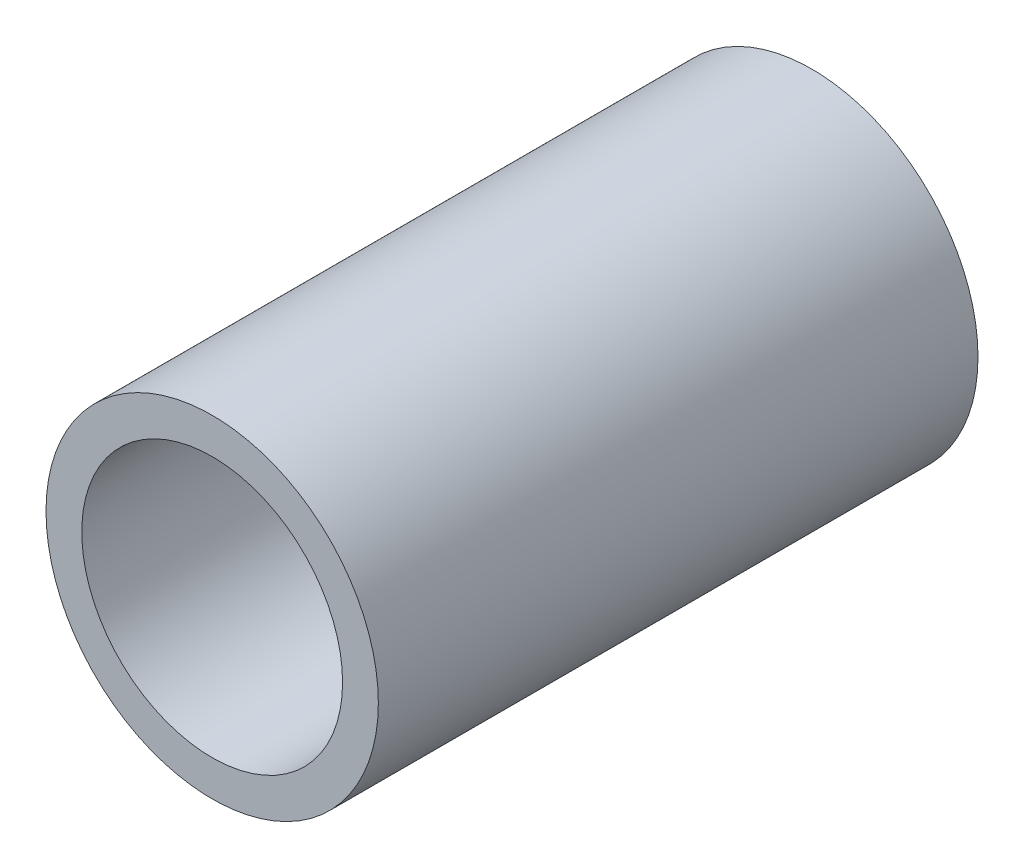
ISO-10303-21;
HEADER;
FILE_DESCRIPTION(('STEP AP214'),'2;1');
FILE_NAME('part.step','',(''),(''),'','','');
FILE_SCHEMA(('AUTOMOTIVE_DESIGN { 1 0 10303 214 1 1 1 1 }'));
ENDSEC;
DATA;
#1=APPLICATION_CONTEXT('core data for automotive mechanical design processes');
#2=APPLICATION_PROTOCOL_DEFINITION('international standard','automotive_design',2000,#1);
#3=PRODUCT_CONTEXT('',#1,'mechanical');
#4=PRODUCT('Part','Part','',(#3));
#5=PRODUCT_RELATED_PRODUCT_CATEGORY('part','',(#4));
#6=PRODUCT_DEFINITION_FORMATION('','',#4);
#7=PRODUCT_DEFINITION_CONTEXT('part definition',#1,'design');
#8=PRODUCT_DEFINITION('design','',#6,#7);
#9=PRODUCT_DEFINITION_SHAPE('','',#8);
#10=(LENGTH_UNIT() NAMED_UNIT(*) SI_UNIT(.MILLI.,.METRE.));
#11=(NAMED_UNIT(*) PLANE_ANGLE_UNIT() SI_UNIT($,.RADIAN.));
#12=(NAMED_UNIT(*) SI_UNIT($,.STERADIAN.) SOLID_ANGLE_UNIT());
#13=UNCERTAINTY_MEASURE_WITH_UNIT(LENGTH_MEASURE(1.E-05),#10,'distance_accuracy_value','');
#14=(GEOMETRIC_REPRESENTATION_CONTEXT(3) GLOBAL_UNCERTAINTY_ASSIGNED_CONTEXT((#13)) GLOBAL_UNIT_ASSIGNED_CONTEXT((#10,
#11,#12)) REPRESENTATION_CONTEXT('',''));
#15=CARTESIAN_POINT('',(0.,0.,0.));
#16=DIRECTION('',(0.,0.,1.));
#17=DIRECTION('',(1.,0.,0.));
#18=AXIS2_PLACEMENT_3D('',#15,#16,#17);
#19=CARTESIAN_POINT('',(0.,0.,762.));
#20=DIRECTION('',(0.,0.,-1.));
#21=DIRECTION('',(-1.,0.,0.));
#22=AXIS2_PLACEMENT_3D('',#19,#20,#21);
#23=CYLINDRICAL_SURFACE('',#22,13.335);
#24=CARTESIAN_POINT('',(0.,0.,-762.));
#25=DIRECTION('',(0.,0.,1.));
#26=DIRECTION('',(1.,0.,0.));
#27=AXIS2_PLACEMENT_3D('',#24,#25,#26);
#28=CIRCLE('',#27,13.335);
#29=CARTESIAN_POINT('',(13.335,0.,-762.));
#30=VERTEX_POINT('',#29);
#31=EDGE_CURVE('E11',#30,#30,#28,.T.);
#32=ORIENTED_EDGE('',*,*,#31,.T.);
#33=EDGE_LOOP('',(#32));
#34=FACE_BOUND('',#33,.T.);
#35=CARTESIAN_POINT('',(0.,0.,-713.87793437));
#36=DIRECTION('',(0.,0.,1.));
#37=DIRECTION('',(1.,0.,0.));
#38=AXIS2_PLACEMENT_3D('',#35,#36,#37);
#39=CIRCLE('',#38,13.335);
#40=CARTESIAN_POINT('',(13.335,0.,-713.87793437));
#41=VERTEX_POINT('',#40);
#42=EDGE_CURVE('E58',#41,#41,#39,.F.);
#43=ORIENTED_EDGE('',*,*,#42,.T.);
#44=EDGE_LOOP('',(#43));
#45=FACE_BOUND('',#44,.T.);
#46=ADVANCED_FACE('F43',(#34,#45),#23,.T.);
#47=CARTESIAN_POINT('',(0.,0.,762.));
#48=DIRECTION('',(0.,0.,-1.));
#49=DIRECTION('',(-1.,0.,0.));
#50=AXIS2_PLACEMENT_3D('',#47,#48,#49);
#51=CYLINDRICAL_SURFACE('',#50,10.4648);
#52=CARTESIAN_POINT('',(0.,0.,-762.));
#53=DIRECTION('',(0.,0.,1.));
#54=DIRECTION('',(1.,0.,0.));
#55=AXIS2_PLACEMENT_3D('',#52,#53,#54);
#56=CIRCLE('',#55,10.4648);
#57=CARTESIAN_POINT('',(10.4648,0.,-762.));
#58=VERTEX_POINT('',#57);
#59=EDGE_CURVE('E51',#58,#58,#56,.T.);
#60=ORIENTED_EDGE('',*,*,#59,.F.);
#61=EDGE_LOOP('',(#60));
#62=FACE_BOUND('',#61,.T.);
#63=CARTESIAN_POINT('',(0.,0.,-713.87793437));
#64=DIRECTION('',(0.,0.,1.));
#65=DIRECTION('',(1.,0.,0.));
#66=AXIS2_PLACEMENT_3D('',#63,#64,#65);
#67=CIRCLE('',#66,10.4648);
#68=CARTESIAN_POINT('',(10.4648,0.,-713.87793437));
#69=VERTEX_POINT('',#68);
#70=EDGE_CURVE('E46',#69,#69,#67,.T.);
#71=ORIENTED_EDGE('',*,*,#70,.T.);
#72=EDGE_LOOP('',(#71));
#73=FACE_BOUND('',#72,.T.);
#74=ADVANCED_FACE('F67',(#62,#73),#51,.F.);
#75=CARTESIAN_POINT('',(0.,0.,-762.));
#76=DIRECTION('',(0.,0.,1.));
#77=DIRECTION('',(1.,0.,0.));
#78=AXIS2_PLACEMENT_3D('',#75,#76,#77);
#79=PLANE('',#78);
#80=ORIENTED_EDGE('',*,*,#59,.T.);
#81=EDGE_LOOP('',(#80));
#82=FACE_BOUND('',#81,.T.);
#83=ORIENTED_EDGE('',*,*,#31,.F.);
#84=EDGE_LOOP('',(#83));
#85=FACE_BOUND('',#84,.T.);
#86=ADVANCED_FACE('F72',(#82,#85),#79,.F.);
#87=CARTESIAN_POINT('',(0.,0.,-713.87793437));
#88=DIRECTION('',(0.,0.,1.));
#89=DIRECTION('',(1.,0.,0.));
#90=AXIS2_PLACEMENT_3D('',#87,#88,#89);
#91=PLANE('',#90);
#92=ORIENTED_EDGE('',*,*,#70,.F.);
#93=EDGE_LOOP('',(#92));
#94=FACE_BOUND('',#93,.T.);
#95=ORIENTED_EDGE('',*,*,#42,.F.);
#96=EDGE_LOOP('',(#95));
#97=FACE_BOUND('',#96,.T.);
#98=ADVANCED_FACE('F69',(#94,#97),#91,.T.);
#99=CLOSED_SHELL('',(#46,#74,#86,#98));
#100=MANIFOLD_SOLID_BREP('B2',#99);
#101=ADVANCED_BREP_SHAPE_REPRESENTATION('',(#18,#100),#14);
#102=SHAPE_DEFINITION_REPRESENTATION(#9,#101);
ENDSEC;
END-ISO-10303-21;
